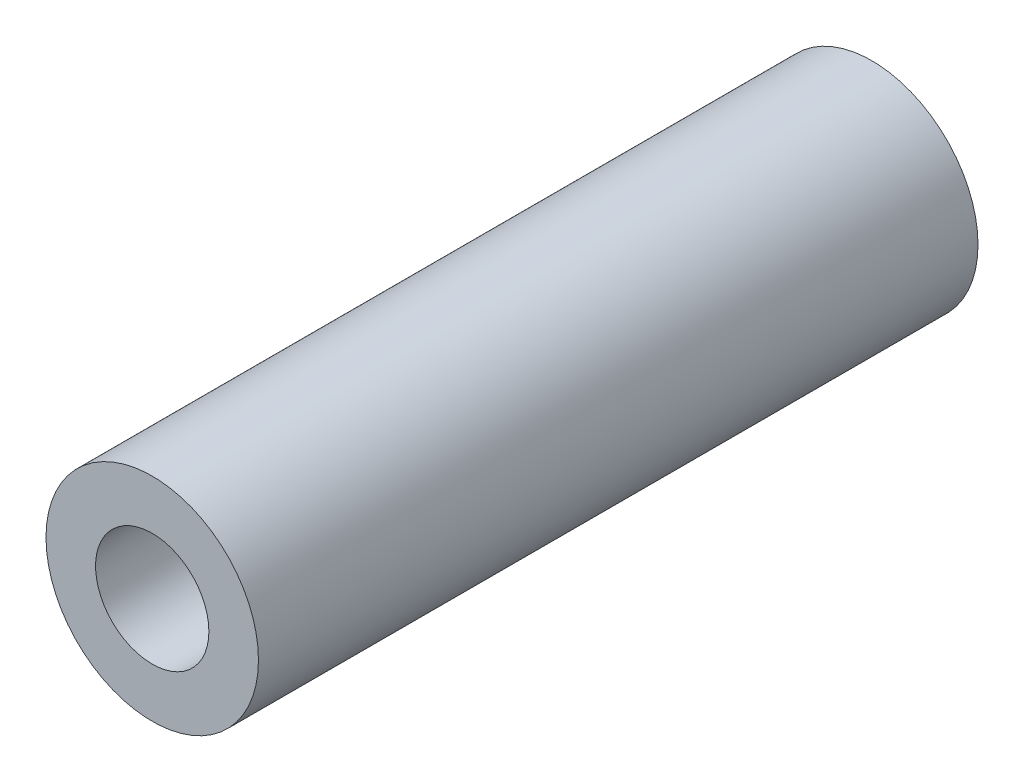
ISO-10303-21;
HEADER;
FILE_DESCRIPTION(('STEP AP214'),'2;1');
FILE_NAME('part.step','',(''),(''),'','','');
FILE_SCHEMA(('AUTOMOTIVE_DESIGN { 1 0 10303 214 1 1 1 1 }'));
ENDSEC;
DATA;
#1=APPLICATION_CONTEXT('core data for automotive mechanical design processes');
#2=APPLICATION_PROTOCOL_DEFINITION('international standard','automotive_design',2000,#1);
#3=PRODUCT_CONTEXT('',#1,'mechanical');
#4=PRODUCT('Part','Part','',(#3));
#5=PRODUCT_RELATED_PRODUCT_CATEGORY('part','',(#4));
#6=PRODUCT_DEFINITION_FORMATION('','',#4);
#7=PRODUCT_DEFINITION_CONTEXT('part definition',#1,'design');
#8=PRODUCT_DEFINITION('design','',#6,#7);
#9=PRODUCT_DEFINITION_SHAPE('','',#8);
#10=(LENGTH_UNIT() NAMED_UNIT(*) SI_UNIT(.MILLI.,.METRE.));
#11=(NAMED_UNIT(*) PLANE_ANGLE_UNIT() SI_UNIT($,.RADIAN.));
#12=(NAMED_UNIT(*) SI_UNIT($,.STERADIAN.) SOLID_ANGLE_UNIT());
#13=UNCERTAINTY_MEASURE_WITH_UNIT(LENGTH_MEASURE(1.E-05),#10,'distance_accuracy_value','');
#14=(GEOMETRIC_REPRESENTATION_CONTEXT(3) GLOBAL_UNCERTAINTY_ASSIGNED_CONTEXT((#13)) GLOBAL_UNIT_ASSIGNED_CONTEXT((#10,
#11,#12)) REPRESENTATION_CONTEXT('',''));
#15=CARTESIAN_POINT('',(0.,0.,0.));
#16=DIRECTION('',(0.,0.,1.));
#17=DIRECTION('',(1.,0.,0.));
#18=AXIS2_PLACEMENT_3D('',#15,#16,#17);
#19=CARTESIAN_POINT('',(0.,0.,25.4));
#20=DIRECTION('',(0.,0.,1.));
#21=DIRECTION('',(1.,0.,0.));
#22=AXIS2_PLACEMENT_3D('',#19,#20,#21);
#23=PLANE('',#22);
#24=CARTESIAN_POINT('',(0.,0.,25.4));
#25=DIRECTION('',(0.,0.,1.));
#26=DIRECTION('',(1.,0.,0.));
#27=AXIS2_PLACEMENT_3D('',#24,#25,#26);
#28=CIRCLE('',#27,3.75);
#29=CARTESIAN_POINT('',(3.75,0.,25.4));
#30=VERTEX_POINT('',#29);
#31=EDGE_CURVE('E10',#30,#30,#28,.T.);
#32=ORIENTED_EDGE('',*,*,#31,.T.);
#33=EDGE_LOOP('',(#32));
#34=FACE_BOUND('',#33,.T.);
#35=CARTESIAN_POINT('',(0.,0.,25.4));
#36=DIRECTION('',(0.,0.,1.));
#37=DIRECTION('',(1.,0.,0.));
#38=AXIS2_PLACEMENT_3D('',#35,#36,#37);
#39=CIRCLE('',#38,2.);
#40=CARTESIAN_POINT('',(2.,0.,25.4));
#41=VERTEX_POINT('',#40);
#42=EDGE_CURVE('E54',#41,#41,#39,.T.);
#43=ORIENTED_EDGE('',*,*,#42,.F.);
#44=EDGE_LOOP('',(#43));
#45=FACE_BOUND('',#44,.T.);
#46=ADVANCED_FACE('F41',(#34,#45),#23,.T.);
#47=CARTESIAN_POINT('',(0.,0.,0.));
#48=DIRECTION('',(0.,0.,1.));
#49=DIRECTION('',(1.,0.,0.));
#50=AXIS2_PLACEMENT_3D('',#47,#48,#49);
#51=PLANE('',#50);
#52=CARTESIAN_POINT('',(0.,0.,0.));
#53=DIRECTION('',(0.,0.,1.));
#54=DIRECTION('',(1.,0.,0.));
#55=AXIS2_PLACEMENT_3D('',#52,#53,#54);
#56=CIRCLE('',#55,3.75);
#57=CARTESIAN_POINT('',(3.75,0.,0.));
#58=VERTEX_POINT('',#57);
#59=EDGE_CURVE('E45',#58,#58,#56,.T.);
#60=ORIENTED_EDGE('',*,*,#59,.F.);
#61=EDGE_LOOP('',(#60));
#62=FACE_BOUND('',#61,.T.);
#63=CARTESIAN_POINT('',(0.,0.,0.));
#64=DIRECTION('',(0.,0.,1.));
#65=DIRECTION('',(1.,0.,0.));
#66=AXIS2_PLACEMENT_3D('',#63,#64,#65);
#67=CIRCLE('',#66,2.);
#68=CARTESIAN_POINT('',(2.,0.,0.));
#69=VERTEX_POINT('',#68);
#70=EDGE_CURVE('E56',#69,#69,#67,.T.);
#71=ORIENTED_EDGE('',*,*,#70,.T.);
#72=EDGE_LOOP('',(#71));
#73=FACE_BOUND('',#72,.T.);
#74=ADVANCED_FACE('F68',(#62,#73),#51,.F.);
#75=CARTESIAN_POINT('',(0.,0.,25.4));
#76=DIRECTION('',(0.,0.,-1.));
#77=DIRECTION('',(-1.,0.,0.));
#78=AXIS2_PLACEMENT_3D('',#75,#76,#77);
#79=CYLINDRICAL_SURFACE('',#78,3.75);
#80=ORIENTED_EDGE('',*,*,#31,.F.);
#81=EDGE_LOOP('',(#80));
#82=FACE_BOUND('',#81,.T.);
#83=ORIENTED_EDGE('',*,*,#59,.T.);
#84=EDGE_LOOP('',(#83));
#85=FACE_BOUND('',#84,.T.);
#86=ADVANCED_FACE('F43',(#82,#85),#79,.T.);
#87=CARTESIAN_POINT('',(0.,0.,25.4));
#88=DIRECTION('',(0.,0.,-1.));
#89=DIRECTION('',(-1.,0.,0.));
#90=AXIS2_PLACEMENT_3D('',#87,#88,#89);
#91=CYLINDRICAL_SURFACE('',#90,2.);
#92=ORIENTED_EDGE('',*,*,#42,.T.);
#93=EDGE_LOOP('',(#92));
#94=FACE_BOUND('',#93,.T.);
#95=ORIENTED_EDGE('',*,*,#70,.F.);
#96=EDGE_LOOP('',(#95));
#97=FACE_BOUND('',#96,.T.);
#98=ADVANCED_FACE('F64',(#94,#97),#91,.F.);
#99=CLOSED_SHELL('',(#46,#74,#86,#98));
#100=MANIFOLD_SOLID_BREP('B2',#99);
#101=ADVANCED_BREP_SHAPE_REPRESENTATION('',(#18,#100),#14);
#102=SHAPE_DEFINITION_REPRESENTATION(#9,#101);
ENDSEC;
END-ISO-10303-21;
